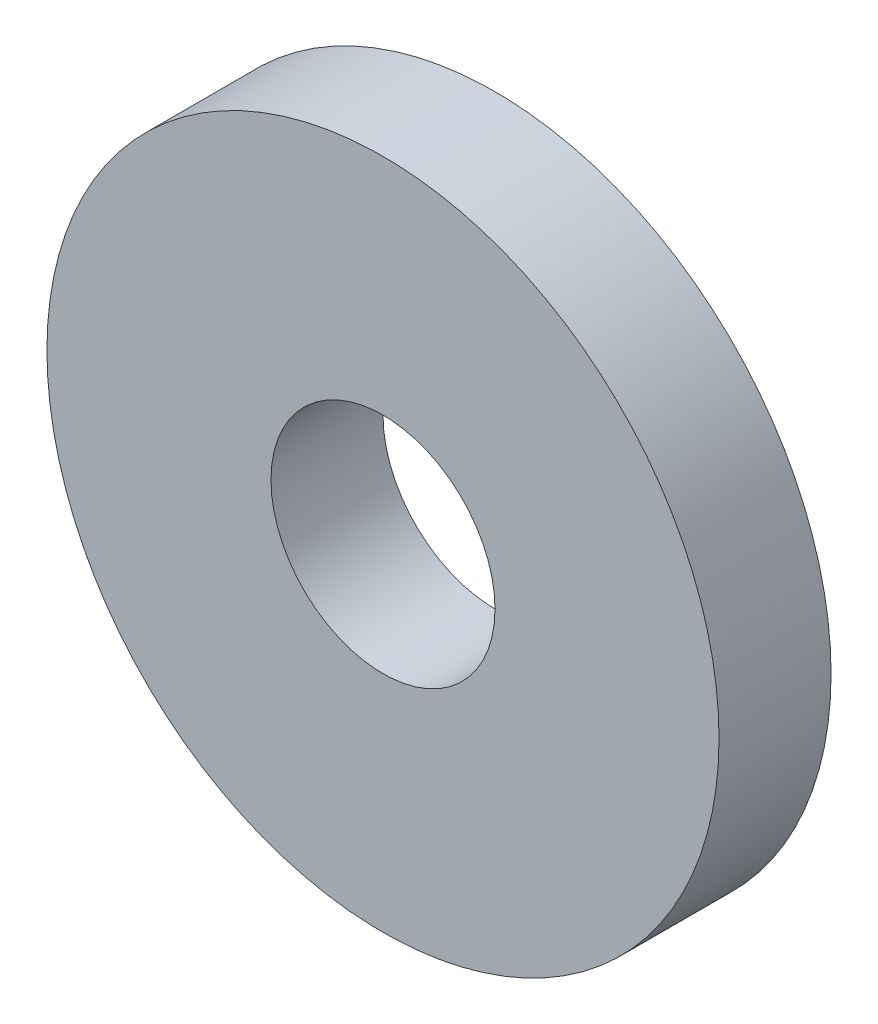
ISO-10303-21;
HEADER;
FILE_DESCRIPTION(('STEP AP214'),'2;1');
FILE_NAME('part.step','',(''),(''),'','','');
FILE_SCHEMA(('AUTOMOTIVE_DESIGN { 1 0 10303 214 1 1 1 1 }'));
ENDSEC;
DATA;
#1=APPLICATION_CONTEXT('core data for automotive mechanical design processes');
#2=APPLICATION_PROTOCOL_DEFINITION('international standard','automotive_design',2000,#1);
#3=PRODUCT_CONTEXT('',#1,'mechanical');
#4=PRODUCT('Part','Part','',(#3));
#5=PRODUCT_RELATED_PRODUCT_CATEGORY('part','',(#4));
#6=PRODUCT_DEFINITION_FORMATION('','',#4);
#7=PRODUCT_DEFINITION_CONTEXT('part definition',#1,'design');
#8=PRODUCT_DEFINITION('design','',#6,#7);
#9=PRODUCT_DEFINITION_SHAPE('','',#8);
#10=(LENGTH_UNIT() NAMED_UNIT(*) SI_UNIT(.MILLI.,.METRE.));
#11=(NAMED_UNIT(*) PLANE_ANGLE_UNIT() SI_UNIT($,.RADIAN.));
#12=(NAMED_UNIT(*) SI_UNIT($,.STERADIAN.) SOLID_ANGLE_UNIT());
#13=UNCERTAINTY_MEASURE_WITH_UNIT(LENGTH_MEASURE(1.E-05),#10,'distance_accuracy_value','');
#14=(GEOMETRIC_REPRESENTATION_CONTEXT(3) GLOBAL_UNCERTAINTY_ASSIGNED_CONTEXT((#13)) GLOBAL_UNIT_ASSIGNED_CONTEXT((#10,
#11,#12)) REPRESENTATION_CONTEXT('',''));
#15=CARTESIAN_POINT('',(0.,0.,0.));
#16=DIRECTION('',(0.,0.,1.));
#17=DIRECTION('',(1.,0.,0.));
#18=AXIS2_PLACEMENT_3D('',#15,#16,#17);
#19=CARTESIAN_POINT('',(0.,0.,5.));
#20=DIRECTION('',(0.,0.,1.));
#21=DIRECTION('',(1.,0.,0.));
#22=AXIS2_PLACEMENT_3D('',#19,#20,#21);
#23=PLANE('',#22);
#24=CARTESIAN_POINT('',(0.,0.,5.));
#25=DIRECTION('',(0.,0.,1.));
#26=DIRECTION('',(1.,0.,0.));
#27=AXIS2_PLACEMENT_3D('',#24,#25,#26);
#28=CIRCLE('',#27,15.);
#29=CARTESIAN_POINT('',(15.,0.,5.));
#30=VERTEX_POINT('',#29);
#31=EDGE_CURVE('E10',#30,#30,#28,.T.);
#32=ORIENTED_EDGE('',*,*,#31,.T.);
#33=EDGE_LOOP('',(#32));
#34=FACE_BOUND('',#33,.T.);
#35=CARTESIAN_POINT('',(0.,0.,5.));
#36=DIRECTION('',(0.,0.,1.));
#37=DIRECTION('',(1.,0.,0.));
#38=AXIS2_PLACEMENT_3D('',#35,#36,#37);
#39=CIRCLE('',#38,5.);
#40=CARTESIAN_POINT('',(5.,0.,5.));
#41=VERTEX_POINT('',#40);
#42=EDGE_CURVE('E46',#41,#41,#39,.T.);
#43=ORIENTED_EDGE('',*,*,#42,.F.);
#44=EDGE_LOOP('',(#43));
#45=FACE_BOUND('',#44,.T.);
#46=ADVANCED_FACE('F35',(#34,#45),#23,.T.);
#47=CARTESIAN_POINT('',(0.,0.,0.));
#48=DIRECTION('',(0.,0.,1.));
#49=DIRECTION('',(1.,0.,0.));
#50=AXIS2_PLACEMENT_3D('',#47,#48,#49);
#51=PLANE('',#50);
#52=CARTESIAN_POINT('',(0.,0.,0.));
#53=DIRECTION('',(0.,0.,1.));
#54=DIRECTION('',(1.,0.,0.));
#55=AXIS2_PLACEMENT_3D('',#52,#53,#54);
#56=CIRCLE('',#55,15.);
#57=CARTESIAN_POINT('',(15.,0.,0.));
#58=VERTEX_POINT('',#57);
#59=EDGE_CURVE('E39',#58,#58,#56,.T.);
#60=ORIENTED_EDGE('',*,*,#59,.F.);
#61=EDGE_LOOP('',(#60));
#62=FACE_BOUND('',#61,.T.);
#63=CARTESIAN_POINT('',(0.,0.,0.));
#64=DIRECTION('',(0.,0.,1.));
#65=DIRECTION('',(1.,0.,0.));
#66=AXIS2_PLACEMENT_3D('',#63,#64,#65);
#67=CIRCLE('',#66,5.);
#68=CARTESIAN_POINT('',(5.,0.,0.));
#69=VERTEX_POINT('',#68);
#70=EDGE_CURVE('E48',#69,#69,#67,.T.);
#71=ORIENTED_EDGE('',*,*,#70,.T.);
#72=EDGE_LOOP('',(#71));
#73=FACE_BOUND('',#72,.T.);
#74=ADVANCED_FACE('F58',(#62,#73),#51,.F.);
#75=CARTESIAN_POINT('',(0.,0.,5.));
#76=DIRECTION('',(0.,0.,-1.));
#77=DIRECTION('',(-1.,0.,0.));
#78=AXIS2_PLACEMENT_3D('',#75,#76,#77);
#79=CYLINDRICAL_SURFACE('',#78,15.);
#80=ORIENTED_EDGE('',*,*,#31,.F.);
#81=EDGE_LOOP('',(#80));
#82=FACE_BOUND('',#81,.T.);
#83=ORIENTED_EDGE('',*,*,#59,.T.);
#84=EDGE_LOOP('',(#83));
#85=FACE_BOUND('',#84,.T.);
#86=ADVANCED_FACE('F37',(#82,#85),#79,.T.);
#87=CARTESIAN_POINT('',(0.,0.,5.));
#88=DIRECTION('',(0.,0.,-1.));
#89=DIRECTION('',(-1.,0.,0.));
#90=AXIS2_PLACEMENT_3D('',#87,#88,#89);
#91=CYLINDRICAL_SURFACE('',#90,5.);
#92=ORIENTED_EDGE('',*,*,#42,.T.);
#93=EDGE_LOOP('',(#92));
#94=FACE_BOUND('',#93,.T.);
#95=ORIENTED_EDGE('',*,*,#70,.F.);
#96=EDGE_LOOP('',(#95));
#97=FACE_BOUND('',#96,.T.);
#98=ADVANCED_FACE('F54',(#94,#97),#91,.F.);
#99=CLOSED_SHELL('',(#46,#74,#86,#98));
#100=MANIFOLD_SOLID_BREP('B2',#99);
#101=ADVANCED_BREP_SHAPE_REPRESENTATION('',(#18,#100),#14);
#102=SHAPE_DEFINITION_REPRESENTATION(#9,#101);
ENDSEC;
END-ISO-10303-21;
